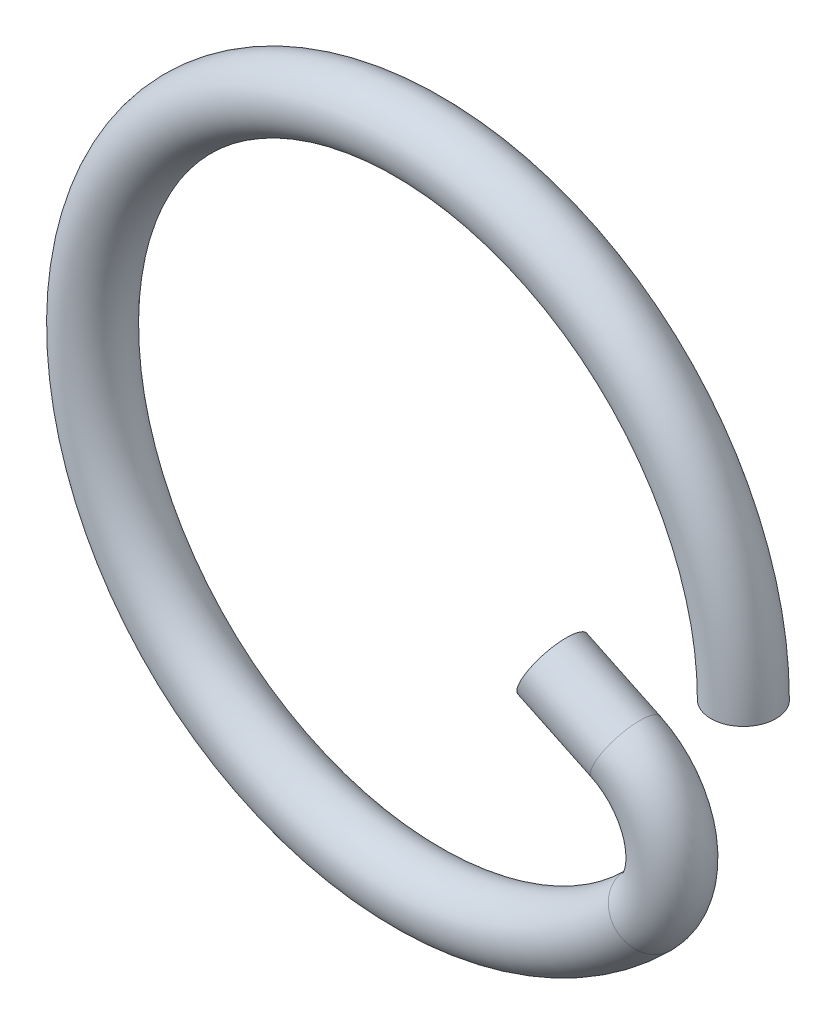
ISO-10303-21;
HEADER;
FILE_DESCRIPTION(('STEP AP214'),'2;1');
FILE_NAME('part.step','',(''),(''),'','','');
FILE_SCHEMA(('AUTOMOTIVE_DESIGN { 1 0 10303 214 1 1 1 1 }'));
ENDSEC;
DATA;
#1=APPLICATION_CONTEXT('core data for automotive mechanical design processes');
#2=APPLICATION_PROTOCOL_DEFINITION('international standard','automotive_design',2000,#1);
#3=PRODUCT_CONTEXT('',#1,'mechanical');
#4=PRODUCT('Part','Part','',(#3));
#5=PRODUCT_RELATED_PRODUCT_CATEGORY('part','',(#4));
#6=PRODUCT_DEFINITION_FORMATION('','',#4);
#7=PRODUCT_DEFINITION_CONTEXT('part definition',#1,'design');
#8=PRODUCT_DEFINITION('design','',#6,#7);
#9=PRODUCT_DEFINITION_SHAPE('','',#8);
#10=(LENGTH_UNIT() NAMED_UNIT(*) SI_UNIT(.MILLI.,.METRE.));
#11=(NAMED_UNIT(*) PLANE_ANGLE_UNIT() SI_UNIT($,.RADIAN.));
#12=(NAMED_UNIT(*) SI_UNIT($,.STERADIAN.) SOLID_ANGLE_UNIT());
#13=UNCERTAINTY_MEASURE_WITH_UNIT(LENGTH_MEASURE(1.E-05),#10,'distance_accuracy_value','');
#14=(GEOMETRIC_REPRESENTATION_CONTEXT(3) GLOBAL_UNCERTAINTY_ASSIGNED_CONTEXT((#13)) GLOBAL_UNIT_ASSIGNED_CONTEXT((#10,
#11,#12)) REPRESENTATION_CONTEXT('',''));
#15=CARTESIAN_POINT('',(0.,0.,0.));
#16=DIRECTION('',(0.,0.,1.));
#17=DIRECTION('',(1.,0.,0.));
#18=AXIS2_PLACEMENT_3D('',#15,#16,#17);
#19=CARTESIAN_POINT('',(1.27614237491537,-0.60947570824872,0.));
#20=DIRECTION('',(-0.902368927062182,0.430964406271153,0.));
#21=DIRECTION('',(-0.430964406271153,-0.902368927062182,0.));
#22=AXIS2_PLACEMENT_3D('',#19,#20,#21);
#23=CYLINDRICAL_SURFACE('',#22,0.2);
#24=CARTESIAN_POINT('',(1.27614237491537,-0.60947570824872,0.));
#25=DIRECTION('',(-0.902368927062188,0.430964406271139,0.));
#26=DIRECTION('',(0.,0.,1.));
#27=AXIS2_PLACEMENT_3D('',#24,#25,#26);
#28=CIRCLE('',#27,0.2);
#29=CARTESIAN_POINT('',(1.36233525616959,-0.429001922836279,0.));
#30=VERTEX_POINT('',#29);
#31=EDGE_CURVE('E35',#30,#30,#28,.T.);
#32=ORIENTED_EDGE('',*,*,#31,.T.);
#33=EDGE_LOOP('',(#32));
#34=FACE_BOUND('',#33,.T.);
#35=CARTESIAN_POINT('',(0.82495791138428,-0.393993505113144,0.));
#36=DIRECTION('',(-0.902368927062188,0.430964406271139,0.));
#37=DIRECTION('',(0.,0.,1.));
#38=AXIS2_PLACEMENT_3D('',#35,#36,#37);
#39=CIRCLE('',#38,0.2);
#40=CARTESIAN_POINT('',(0.82495791138428,-0.393993505113144,0.2));
#41=VERTEX_POINT('',#40);
#42=EDGE_CURVE('E10',#41,#41,#39,.T.);
#43=ORIENTED_EDGE('',*,*,#42,.F.);
#44=EDGE_LOOP('',(#43));
#45=FACE_BOUND('',#44,.T.);
#46=ADVANCED_FACE('F29',(#34,#45),#23,.T.);
#47=CARTESIAN_POINT('',(1.06066017177982,-1.06066017177982,0.));
#48=DIRECTION('',(0.,0.,1.));
#49=DIRECTION('',(1.,0.,0.));
#50=AXIS2_PLACEMENT_3D('',#47,#48,#49);
#51=TOROIDAL_SURFACE('',#50,0.5,0.2);
#52=CARTESIAN_POINT('',(1.41421356237311,-1.41421356237308,0.));
#53=DIRECTION('',(0.707106781186539,0.707106781186556,0.));
#54=DIRECTION('',(0.,0.,1.));
#55=AXIS2_PLACEMENT_3D('',#52,#53,#54);
#56=CIRCLE('',#55,0.2);
#57=CARTESIAN_POINT('',(1.55563491861043,-1.55563491861038,0.));
#58=VERTEX_POINT('',#57);
#59=EDGE_CURVE('E39',#58,#58,#56,.T.);
#60=CARTESIAN_POINT('',(1.06066017177982,-1.06066017177982,0.));
#61=DIRECTION('',(0.,0.,1.));
#62=DIRECTION('',(1.,0.,0.));
#63=AXIS2_PLACEMENT_3D('',#60,#61,#62);
#64=CIRCLE('',#63,0.7);
#65=EDGE_CURVE('',#58,#30,#64,.T.);
#66=ORIENTED_EDGE('',*,*,#59,.T.);
#67=ORIENTED_EDGE('',*,*,#31,.F.);
#68=ORIENTED_EDGE('',*,*,#65,.T.);
#69=ORIENTED_EDGE('',*,*,#65,.F.);
#70=EDGE_LOOP('',(#66,#68,#67,#69));
#71=FACE_BOUND('',#70,.T.);
#72=ADVANCED_FACE('F59',(#71),#51,.T.);
#73=CARTESIAN_POINT('',(0.,0.,0.));
#74=DIRECTION('',(0.,0.,-1.));
#75=DIRECTION('',(-1.,0.,0.));
#76=AXIS2_PLACEMENT_3D('',#73,#74,#75);
#77=TOROIDAL_SURFACE('',#76,2.,0.2);
#78=CARTESIAN_POINT('',(2.,0.,0.));
#79=DIRECTION('',(0.,1.,0.));
#80=DIRECTION('',(0.,0.,1.));
#81=AXIS2_PLACEMENT_3D('',#78,#79,#80);
#82=CIRCLE('',#81,0.2);
#83=CARTESIAN_POINT('',(2.2,0.,0.));
#84=VERTEX_POINT('',#83);
#85=EDGE_CURVE('E43',#84,#84,#82,.T.);
#86=CARTESIAN_POINT('',(0.,0.,0.));
#87=DIRECTION('',(0.,0.,-1.));
#88=DIRECTION('',(-1.,0.,0.));
#89=AXIS2_PLACEMENT_3D('',#86,#87,#88);
#90=CIRCLE('',#89,2.2);
#91=EDGE_CURVE('',#58,#84,#90,.T.);
#92=ORIENTED_EDGE('',*,*,#59,.F.);
#93=ORIENTED_EDGE('',*,*,#85,.T.);
#94=ORIENTED_EDGE('',*,*,#91,.T.);
#95=ORIENTED_EDGE('',*,*,#91,.F.);
#96=EDGE_LOOP('',(#92,#94,#93,#95));
#97=FACE_BOUND('',#96,.T.);
#98=ADVANCED_FACE('F49',(#97),#77,.T.);
#99=CARTESIAN_POINT('',(0.82495791138428,-0.393993505113144,0.));
#100=DIRECTION('',(-0.902368927062188,0.430964406271139,0.));
#101=DIRECTION('',(0.,0.,1.));
#102=AXIS2_PLACEMENT_3D('',#99,#100,#101);
#103=PLANE('',#102);
#104=ORIENTED_EDGE('',*,*,#42,.T.);
#105=EDGE_LOOP('',(#104));
#106=FACE_BOUND('',#105,.T.);
#107=ADVANCED_FACE('F53',(#106),#103,.T.);
#108=CARTESIAN_POINT('',(2.,0.,0.));
#109=DIRECTION('',(0.,1.,0.));
#110=DIRECTION('',(0.,0.,1.));
#111=AXIS2_PLACEMENT_3D('',#108,#109,#110);
#112=PLANE('',#111);
#113=ORIENTED_EDGE('',*,*,#85,.F.);
#114=EDGE_LOOP('',(#113));
#115=FACE_BOUND('',#114,.T.);
#116=ADVANCED_FACE('F51',(#115),#112,.F.);
#117=CLOSED_SHELL('',(#46,#72,#98,#107,#116));
#118=MANIFOLD_SOLID_BREP('B2',#117);
#119=ADVANCED_BREP_SHAPE_REPRESENTATION('',(#18,#118),#14);
#120=SHAPE_DEFINITION_REPRESENTATION(#9,#119);
ENDSEC;
END-ISO-10303-21;
